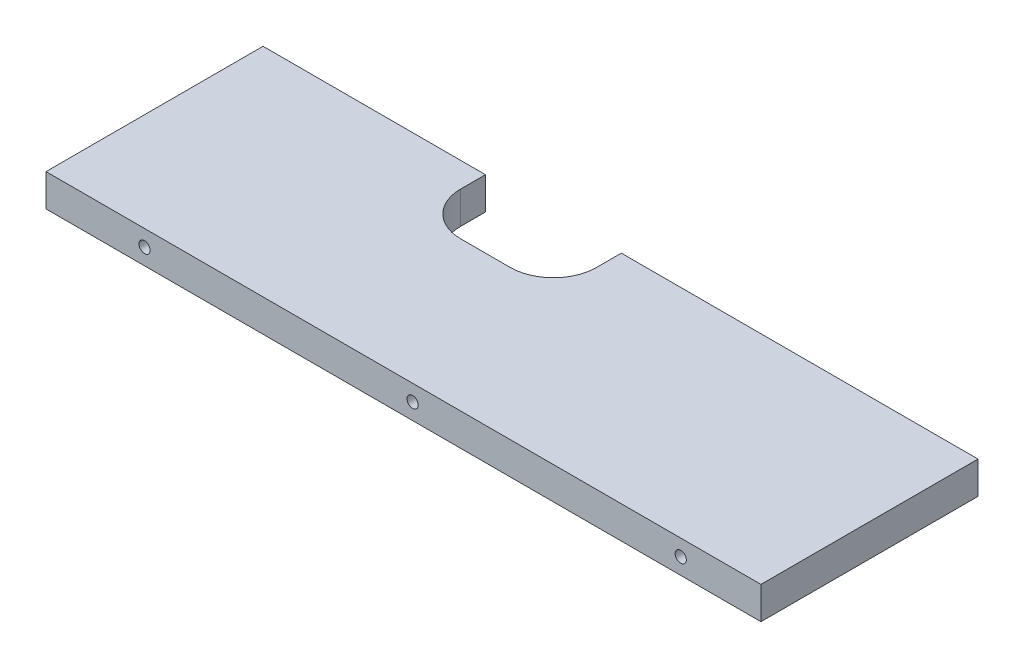
ISO-10303-21;
HEADER;
FILE_DESCRIPTION(('STEP AP214'),'2;1');
FILE_NAME('part.step','',(''),(''),'','','');
FILE_SCHEMA(('AUTOMOTIVE_DESIGN { 1 0 10303 214 1 1 1 1 }'));
ENDSEC;
DATA;
#1=APPLICATION_CONTEXT('core data for automotive mechanical design processes');
#2=APPLICATION_PROTOCOL_DEFINITION('international standard','automotive_design',2000,#1);
#3=PRODUCT_CONTEXT('',#1,'mechanical');
#4=PRODUCT('Part','Part','',(#3));
#5=PRODUCT_RELATED_PRODUCT_CATEGORY('part','',(#4));
#6=PRODUCT_DEFINITION_FORMATION('','',#4);
#7=PRODUCT_DEFINITION_CONTEXT('part definition',#1,'design');
#8=PRODUCT_DEFINITION('design','',#6,#7);
#9=PRODUCT_DEFINITION_SHAPE('','',#8);
#10=(LENGTH_UNIT() NAMED_UNIT(*) SI_UNIT(.MILLI.,.METRE.));
#11=(NAMED_UNIT(*) PLANE_ANGLE_UNIT() SI_UNIT($,.RADIAN.));
#12=(NAMED_UNIT(*) SI_UNIT($,.STERADIAN.) SOLID_ANGLE_UNIT());
#13=UNCERTAINTY_MEASURE_WITH_UNIT(LENGTH_MEASURE(1.E-05),#10,'distance_accuracy_value','');
#14=(GEOMETRIC_REPRESENTATION_CONTEXT(3) GLOBAL_UNCERTAINTY_ASSIGNED_CONTEXT((#13)) GLOBAL_UNIT_ASSIGNED_CONTEXT((#10,
#11,#12)) REPRESENTATION_CONTEXT('',''));
#15=CARTESIAN_POINT('',(0.,0.,0.));
#16=DIRECTION('',(0.,0.,1.));
#17=DIRECTION('',(1.,0.,0.));
#18=AXIS2_PLACEMENT_3D('',#15,#16,#17);
#19=CARTESIAN_POINT('',(0.,0.,0.));
#20=DIRECTION('',(0.,0.,1.));
#21=DIRECTION('',(1.,0.,0.));
#22=AXIS2_PLACEMENT_3D('',#19,#20,#21);
#23=PLANE('',#22);
#24=DIRECTION('',(-1.,0.,0.));
#25=VECTOR('',#24,1.);
#26=CARTESIAN_POINT('',(-105.2375,4.7625,0.));
#27=LINE('',#26,#25);
#28=CARTESIAN_POINT('',(-39.7625,4.7625,0.));
#29=VERTEX_POINT('',#28);
#30=CARTESIAN_POINT('',(-105.2375,4.7625,0.));
#31=VERTEX_POINT('',#30);
#32=EDGE_CURVE('E187',#29,#31,#27,.T.);
#33=ORIENTED_EDGE('',*,*,#32,.F.);
#34=DIRECTION('',(0.,1.,0.));
#35=VECTOR('',#34,1.);
#36=CARTESIAN_POINT('',(-39.7625,-4.7625,0.));
#37=LINE('',#36,#35);
#38=CARTESIAN_POINT('',(-39.7625,-4.7625,0.));
#39=VERTEX_POINT('',#38);
#40=EDGE_CURVE('E163',#39,#29,#37,.T.);
#41=ORIENTED_EDGE('',*,*,#40,.F.);
#42=DIRECTION('',(1.,0.,0.));
#43=VECTOR('',#42,1.);
#44=CARTESIAN_POINT('',(-105.2375,-4.7625,0.));
#45=LINE('',#44,#43);
#46=CARTESIAN_POINT('',(-105.2375,-4.7625,0.));
#47=VERTEX_POINT('',#46);
#48=EDGE_CURVE('E182',#47,#39,#45,.T.);
#49=ORIENTED_EDGE('',*,*,#48,.F.);
#50=DIRECTION('',(0.,-1.,0.));
#51=VECTOR('',#50,1.);
#52=CARTESIAN_POINT('',(-105.2375,4.7625,0.));
#53=LINE('',#52,#51);
#54=EDGE_CURVE('E165',#31,#47,#53,.T.);
#55=ORIENTED_EDGE('',*,*,#54,.F.);
#56=EDGE_LOOP('',(#33,#41,#49,#55));
#57=FACE_BOUND('',#56,.T.);
#58=ADVANCED_FACE('F38',(#57),#23,.F.);
#59=CARTESIAN_POINT('',(-105.2375,4.7625,63.9));
#60=DIRECTION('',(1.,0.,0.));
#61=DIRECTION('',(0.,0.,-1.));
#62=AXIS2_PLACEMENT_3D('',#59,#60,#61);
#63=PLANE('',#62);
#64=ORIENTED_EDGE('',*,*,#54,.T.);
#65=DIRECTION('',(0.,0.,-1.));
#66=VECTOR('',#65,1.);
#67=CARTESIAN_POINT('',(-105.2375,-4.7625,63.9));
#68=LINE('',#67,#66);
#69=CARTESIAN_POINT('',(-105.2375,-4.7625,63.9));
#70=VERTEX_POINT('',#69);
#71=EDGE_CURVE('E198',#70,#47,#68,.T.);
#72=ORIENTED_EDGE('',*,*,#71,.F.);
#73=DIRECTION('',(0.,-1.,0.));
#74=VECTOR('',#73,1.);
#75=CARTESIAN_POINT('',(-105.2375,4.7625,63.9));
#76=LINE('',#75,#74);
#77=CARTESIAN_POINT('',(-105.2375,4.7625,63.9));
#78=VERTEX_POINT('',#77);
#79=EDGE_CURVE('E168',#78,#70,#76,.T.);
#80=ORIENTED_EDGE('',*,*,#79,.F.);
#81=DIRECTION('',(0.,0.,-1.));
#82=VECTOR('',#81,1.);
#83=CARTESIAN_POINT('',(-105.2375,4.7625,63.9));
#84=LINE('',#83,#82);
#85=EDGE_CURVE('E178',#78,#31,#84,.T.);
#86=ORIENTED_EDGE('',*,*,#85,.T.);
#87=EDGE_LOOP('',(#64,#72,#80,#86));
#88=FACE_BOUND('',#87,.T.);
#89=ADVANCED_FACE('F242',(#88),#63,.F.);
#90=CARTESIAN_POINT('',(-105.2375,-4.7625,63.9));
#91=DIRECTION('',(0.,1.,0.));
#92=DIRECTION('',(0.,0.,1.));
#93=AXIS2_PLACEMENT_3D('',#90,#91,#92);
#94=PLANE('',#93);
#95=ORIENTED_EDGE('',*,*,#48,.T.);
#96=DIRECTION('',(0.,0.,1.));
#97=VECTOR('',#96,1.);
#98=CARTESIAN_POINT('',(-39.7625,-4.7625,0.));
#99=LINE('',#98,#97);
#100=CARTESIAN_POINT('',(-39.7625,-4.7625,7.3));
#101=VERTEX_POINT('',#100);
#102=EDGE_CURVE('E149',#39,#101,#99,.T.);
#103=ORIENTED_EDGE('',*,*,#102,.T.);
#104=CARTESIAN_POINT('',(-27.0625,-4.7625,7.3));
#105=DIRECTION('',(0.,1.,0.));
#106=DIRECTION('',(0.,0.,1.));
#107=AXIS2_PLACEMENT_3D('',#104,#105,#106);
#108=CIRCLE('',#107,12.7);
#109=CARTESIAN_POINT('',(-27.0625,-4.7625,20.));
#110=VERTEX_POINT('',#109);
#111=EDGE_CURVE('E11',#101,#110,#108,.T.);
#112=ORIENTED_EDGE('',*,*,#111,.T.);
#113=DIRECTION('',(1.,0.,0.));
#114=VECTOR('',#113,1.);
#115=CARTESIAN_POINT('',(-39.7625,-4.7625,20.));
#116=LINE('',#115,#114);
#117=CARTESIAN_POINT('',(-12.4625,-4.7625,20.));
#118=VERTEX_POINT('',#117);
#119=EDGE_CURVE('E151',#110,#118,#116,.T.);
#120=ORIENTED_EDGE('',*,*,#119,.T.);
#121=CARTESIAN_POINT('',(-12.4625,-4.7625,7.3));
#122=DIRECTION('',(0.,1.,0.));
#123=DIRECTION('',(0.,0.,1.));
#124=AXIS2_PLACEMENT_3D('',#121,#122,#123);
#125=CIRCLE('',#124,12.7);
#126=CARTESIAN_POINT('',(0.237500000000003,-4.7625,7.3));
#127=VERTEX_POINT('',#126);
#128=EDGE_CURVE('E212',#118,#127,#125,.T.);
#129=ORIENTED_EDGE('',*,*,#128,.T.);
#130=DIRECTION('',(0.,0.,-1.));
#131=VECTOR('',#130,1.);
#132=CARTESIAN_POINT('',(0.237500000000002,-4.7625,0.));
#133=LINE('',#132,#131);
#134=CARTESIAN_POINT('',(0.237500000000002,-4.7625,0.));
#135=VERTEX_POINT('',#134);
#136=EDGE_CURVE('E155',#127,#135,#133,.T.);
#137=ORIENTED_EDGE('',*,*,#136,.T.);
#138=CARTESIAN_POINT('',(105.2375,-4.7625,0.));
#139=VERTEX_POINT('',#138);
#140=EDGE_CURVE('E181',#135,#139,#45,.T.);
#141=ORIENTED_EDGE('',*,*,#140,.T.);
#142=DIRECTION('',(0.,0.,-1.));
#143=VECTOR('',#142,1.);
#144=CARTESIAN_POINT('',(105.2375,-4.7625,63.9));
#145=LINE('',#144,#143);
#146=CARTESIAN_POINT('',(105.2375,-4.7625,63.9));
#147=VERTEX_POINT('',#146);
#148=EDGE_CURVE('E195',#147,#139,#145,.T.);
#149=ORIENTED_EDGE('',*,*,#148,.F.);
#150=DIRECTION('',(1.,0.,0.));
#151=VECTOR('',#150,1.);
#152=CARTESIAN_POINT('',(-105.2375,-4.7625,63.9));
#153=LINE('',#152,#151);
#154=EDGE_CURVE('E171',#70,#147,#153,.T.);
#155=ORIENTED_EDGE('',*,*,#154,.F.);
#156=ORIENTED_EDGE('',*,*,#71,.T.);
#157=EDGE_LOOP('',(#95,#103,#112,#120,#129,#137,#141,#149,#155,#156));
#158=FACE_BOUND('',#157,.T.);
#159=ADVANCED_FACE('F216',(#158),#94,.F.);
#160=CARTESIAN_POINT('',(105.2375,4.7625,63.9));
#161=DIRECTION('',(-1.,0.,0.));
#162=DIRECTION('',(0.,0.,1.));
#163=AXIS2_PLACEMENT_3D('',#160,#161,#162);
#164=PLANE('',#163);
#165=DIRECTION('',(0.,1.,0.));
#166=VECTOR('',#165,1.);
#167=CARTESIAN_POINT('',(105.2375,4.7625,0.));
#168=LINE('',#167,#166);
#169=CARTESIAN_POINT('',(105.2375,4.7625,0.));
#170=VERTEX_POINT('',#169);
#171=EDGE_CURVE('E185',#139,#170,#168,.T.);
#172=ORIENTED_EDGE('',*,*,#171,.T.);
#173=DIRECTION('',(0.,0.,-1.));
#174=VECTOR('',#173,1.);
#175=CARTESIAN_POINT('',(105.2375,4.7625,63.9));
#176=LINE('',#175,#174);
#177=CARTESIAN_POINT('',(105.2375,4.7625,63.9));
#178=VERTEX_POINT('',#177);
#179=EDGE_CURVE('E192',#178,#170,#176,.T.);
#180=ORIENTED_EDGE('',*,*,#179,.F.);
#181=DIRECTION('',(0.,1.,0.));
#182=VECTOR('',#181,1.);
#183=CARTESIAN_POINT('',(105.2375,4.7625,63.9));
#184=LINE('',#183,#182);
#185=EDGE_CURVE('E174',#147,#178,#184,.T.);
#186=ORIENTED_EDGE('',*,*,#185,.F.);
#187=ORIENTED_EDGE('',*,*,#148,.T.);
#188=EDGE_LOOP('',(#172,#180,#186,#187));
#189=FACE_BOUND('',#188,.T.);
#190=ADVANCED_FACE('F254',(#189),#164,.F.);
#191=CARTESIAN_POINT('',(-105.2375,4.7625,63.9));
#192=DIRECTION('',(0.,-1.,0.));
#193=DIRECTION('',(0.,0.,-1.));
#194=AXIS2_PLACEMENT_3D('',#191,#192,#193);
#195=PLANE('',#194);
#196=DIRECTION('',(1.,0.,0.));
#197=VECTOR('',#196,1.);
#198=CARTESIAN_POINT('',(-39.7625,4.7625,20.));
#199=LINE('',#198,#197);
#200=CARTESIAN_POINT('',(-27.0625,4.7625,20.));
#201=VERTEX_POINT('',#200);
#202=CARTESIAN_POINT('',(-12.4625,4.7625,20.));
#203=VERTEX_POINT('',#202);
#204=EDGE_CURVE('E159',#201,#203,#199,.T.);
#205=ORIENTED_EDGE('',*,*,#204,.F.);
#206=CARTESIAN_POINT('',(-27.0625,4.7625,7.3));
#207=DIRECTION('',(0.,-1.,0.));
#208=DIRECTION('',(0.,0.,-1.));
#209=AXIS2_PLACEMENT_3D('',#206,#207,#208);
#210=CIRCLE('',#209,12.7);
#211=CARTESIAN_POINT('',(-39.7625,4.7625,7.3));
#212=VERTEX_POINT('',#211);
#213=EDGE_CURVE('E46',#201,#212,#210,.T.);
#214=ORIENTED_EDGE('',*,*,#213,.T.);
#215=DIRECTION('',(0.,0.,1.));
#216=VECTOR('',#215,1.);
#217=CARTESIAN_POINT('',(-39.7625,4.7625,0.));
#218=LINE('',#217,#216);
#219=EDGE_CURVE('E148',#29,#212,#218,.T.);
#220=ORIENTED_EDGE('',*,*,#219,.F.);
#221=ORIENTED_EDGE('',*,*,#32,.T.);
#222=ORIENTED_EDGE('',*,*,#85,.F.);
#223=DIRECTION('',(-1.,0.,0.));
#224=VECTOR('',#223,1.);
#225=CARTESIAN_POINT('',(-105.2375,4.7625,63.9));
#226=LINE('',#225,#224);
#227=EDGE_CURVE('E176',#178,#78,#226,.T.);
#228=ORIENTED_EDGE('',*,*,#227,.F.);
#229=ORIENTED_EDGE('',*,*,#179,.T.);
#230=CARTESIAN_POINT('',(0.237500000000002,4.7625,0.));
#231=VERTEX_POINT('',#230);
#232=EDGE_CURVE('E172',#170,#231,#27,.T.);
#233=ORIENTED_EDGE('',*,*,#232,.T.);
#234=DIRECTION('',(0.,0.,-1.));
#235=VECTOR('',#234,1.);
#236=CARTESIAN_POINT('',(0.237500000000002,4.7625,0.));
#237=LINE('',#236,#235);
#238=CARTESIAN_POINT('',(0.237500000000003,4.7625,7.3));
#239=VERTEX_POINT('',#238);
#240=EDGE_CURVE('E152',#239,#231,#237,.T.);
#241=ORIENTED_EDGE('',*,*,#240,.F.);
#242=CARTESIAN_POINT('',(-12.4625,4.7625,7.3));
#243=DIRECTION('',(0.,-1.,0.));
#244=DIRECTION('',(0.,0.,-1.));
#245=AXIS2_PLACEMENT_3D('',#242,#243,#244);
#246=CIRCLE('',#245,12.7);
#247=EDGE_CURVE('E210',#239,#203,#246,.T.);
#248=ORIENTED_EDGE('',*,*,#247,.T.);
#249=EDGE_LOOP('',(#205,#214,#220,#221,#222,#228,#229,#233,#241,#248));
#250=FACE_BOUND('',#249,.T.);
#251=ADVANCED_FACE('F227',(#250),#195,.F.);
#252=CARTESIAN_POINT('',(0.,0.,63.9));
#253=DIRECTION('',(0.,0.,1.));
#254=DIRECTION('',(1.,0.,0.));
#255=AXIS2_PLACEMENT_3D('',#252,#253,#254);
#256=PLANE('',#255);
#257=CARTESIAN_POINT('',(-76.2285,0.,63.9));
#258=DIRECTION('',(0.,0.,1.));
#259=DIRECTION('',(1.,0.,0.));
#260=AXIS2_PLACEMENT_3D('',#257,#258,#259);
#261=CIRCLE('',#260,1.65);
#262=CARTESIAN_POINT('',(-74.5785,0.,63.9));
#263=VERTEX_POINT('',#262);
#264=EDGE_CURVE('E132',#263,#263,#261,.T.);
#265=ORIENTED_EDGE('',*,*,#264,.F.);
#266=EDGE_LOOP('',(#265));
#267=FACE_BOUND('',#266,.T.);
#268=CARTESIAN_POINT('',(2.69949999999999,0.,63.9));
#269=DIRECTION('',(0.,0.,1.));
#270=DIRECTION('',(1.,0.,0.));
#271=AXIS2_PLACEMENT_3D('',#268,#269,#270);
#272=CIRCLE('',#271,1.64999999999999);
#273=CARTESIAN_POINT('',(4.34949999999999,0.,63.9));
#274=VERTEX_POINT('',#273);
#275=EDGE_CURVE('E131',#274,#274,#272,.T.);
#276=ORIENTED_EDGE('',*,*,#275,.F.);
#277=EDGE_LOOP('',(#276));
#278=FACE_BOUND('',#277,.T.);
#279=CARTESIAN_POINT('',(81.6285,0.,63.9));
#280=DIRECTION('',(0.,0.,1.));
#281=DIRECTION('',(1.,0.,0.));
#282=AXIS2_PLACEMENT_3D('',#279,#280,#281);
#283=CIRCLE('',#282,1.65);
#284=CARTESIAN_POINT('',(83.2785,0.,63.9));
#285=VERTEX_POINT('',#284);
#286=EDGE_CURVE('E142',#285,#285,#283,.T.);
#287=ORIENTED_EDGE('',*,*,#286,.F.);
#288=EDGE_LOOP('',(#287));
#289=FACE_BOUND('',#288,.T.);
#290=ORIENTED_EDGE('',*,*,#79,.T.);
#291=ORIENTED_EDGE('',*,*,#154,.T.);
#292=ORIENTED_EDGE('',*,*,#185,.T.);
#293=ORIENTED_EDGE('',*,*,#227,.T.);
#294=EDGE_LOOP('',(#290,#291,#292,#293));
#295=FACE_BOUND('',#294,.T.);
#296=ADVANCED_FACE('F245',(#267,#278,#289,#295),#256,.T.);
#297=ORIENTED_EDGE('',*,*,#140,.F.);
#298=DIRECTION('',(0.,1.,0.));
#299=VECTOR('',#298,1.);
#300=CARTESIAN_POINT('',(0.237500000000002,-4.7625,0.));
#301=LINE('',#300,#299);
#302=EDGE_CURVE('E157',#135,#231,#301,.T.);
#303=ORIENTED_EDGE('',*,*,#302,.T.);
#304=ORIENTED_EDGE('',*,*,#232,.F.);
#305=ORIENTED_EDGE('',*,*,#171,.F.);
#306=EDGE_LOOP('',(#297,#303,#304,#305));
#307=FACE_BOUND('',#306,.T.);
#308=ADVANCED_FACE('F253',(#307),#23,.F.);
#309=CARTESIAN_POINT('',(-39.7625,-4.7625,0.));
#310=DIRECTION('',(-1.,0.,0.));
#311=DIRECTION('',(0.,0.,1.));
#312=AXIS2_PLACEMENT_3D('',#309,#310,#311);
#313=PLANE('',#312);
#314=ORIENTED_EDGE('',*,*,#219,.T.);
#315=DIRECTION('',(0.,1.,0.));
#316=VECTOR('',#315,1.);
#317=CARTESIAN_POINT('',(-39.7625,-4.7625,7.3));
#318=LINE('',#317,#316);
#319=EDGE_CURVE('E53',#212,#101,#318,.F.);
#320=ORIENTED_EDGE('',*,*,#319,.T.);
#321=ORIENTED_EDGE('',*,*,#102,.F.);
#322=ORIENTED_EDGE('',*,*,#40,.T.);
#323=EDGE_LOOP('',(#314,#320,#321,#322));
#324=FACE_BOUND('',#323,.T.);
#325=ADVANCED_FACE('F234',(#324),#313,.F.);
#326=CARTESIAN_POINT('',(0.237500000000002,-4.7625,0.));
#327=DIRECTION('',(1.,0.,0.));
#328=DIRECTION('',(0.,0.,-1.));
#329=AXIS2_PLACEMENT_3D('',#326,#327,#328);
#330=PLANE('',#329);
#331=ORIENTED_EDGE('',*,*,#136,.F.);
#332=DIRECTION('',(0.,1.,0.));
#333=VECTOR('',#332,1.);
#334=CARTESIAN_POINT('',(0.237500000000003,4.7625,7.3));
#335=LINE('',#334,#333);
#336=EDGE_CURVE('E201',#127,#239,#335,.T.);
#337=ORIENTED_EDGE('',*,*,#336,.T.);
#338=ORIENTED_EDGE('',*,*,#240,.T.);
#339=ORIENTED_EDGE('',*,*,#302,.F.);
#340=EDGE_LOOP('',(#331,#337,#338,#339));
#341=FACE_BOUND('',#340,.T.);
#342=ADVANCED_FACE('F223',(#341),#330,.F.);
#343=CARTESIAN_POINT('',(-39.7625,-4.7625,20.));
#344=DIRECTION('',(0.,0.,1.));
#345=DIRECTION('',(1.,0.,0.));
#346=AXIS2_PLACEMENT_3D('',#343,#344,#345);
#347=PLANE('',#346);
#348=ORIENTED_EDGE('',*,*,#204,.T.);
#349=DIRECTION('',(0.,1.,0.));
#350=VECTOR('',#349,1.);
#351=CARTESIAN_POINT('',(-12.4625,-4.7625,20.));
#352=LINE('',#351,#350);
#353=EDGE_CURVE('E207',#203,#118,#352,.F.);
#354=ORIENTED_EDGE('',*,*,#353,.T.);
#355=ORIENTED_EDGE('',*,*,#119,.F.);
#356=DIRECTION('',(0.,1.,0.));
#357=VECTOR('',#356,1.);
#358=CARTESIAN_POINT('',(-27.0625,4.7625,20.));
#359=LINE('',#358,#357);
#360=EDGE_CURVE('E204',#110,#201,#359,.T.);
#361=ORIENTED_EDGE('',*,*,#360,.T.);
#362=EDGE_LOOP('',(#348,#354,#355,#361));
#363=FACE_BOUND('',#362,.T.);
#364=ADVANCED_FACE('F229',(#363),#347,.F.);
#365=CARTESIAN_POINT('',(-12.4625,-4.7625,7.3));
#366=DIRECTION('',(0.,-1.,0.));
#367=DIRECTION('',(0.,0.,-1.));
#368=AXIS2_PLACEMENT_3D('',#365,#366,#367);
#369=CYLINDRICAL_SURFACE('',#368,12.7);
#370=ORIENTED_EDGE('',*,*,#128,.F.);
#371=ORIENTED_EDGE('',*,*,#353,.F.);
#372=ORIENTED_EDGE('',*,*,#247,.F.);
#373=ORIENTED_EDGE('',*,*,#336,.F.);
#374=EDGE_LOOP('',(#370,#371,#372,#373));
#375=FACE_BOUND('',#374,.T.);
#376=ADVANCED_FACE('F226',(#375),#369,.F.);
#377=CARTESIAN_POINT('',(-27.0625,-4.7625,7.3));
#378=DIRECTION('',(0.,-1.,0.));
#379=DIRECTION('',(0.,0.,-1.));
#380=AXIS2_PLACEMENT_3D('',#377,#378,#379);
#381=CYLINDRICAL_SURFACE('',#380,12.7);
#382=ORIENTED_EDGE('',*,*,#111,.F.);
#383=ORIENTED_EDGE('',*,*,#319,.F.);
#384=ORIENTED_EDGE('',*,*,#213,.F.);
#385=ORIENTED_EDGE('',*,*,#360,.F.);
#386=EDGE_LOOP('',(#382,#383,#384,#385));
#387=FACE_BOUND('',#386,.T.);
#388=ADVANCED_FACE('F40',(#387),#381,.F.);
#389=CARTESIAN_POINT('',(81.6285,0.,51.2));
#390=DIRECTION('',(0.,0.,1.));
#391=DIRECTION('',(1.,0.,0.));
#392=AXIS2_PLACEMENT_3D('',#389,#390,#391);
#393=CONICAL_SURFACE('',#392,1.65,1.02974425867665);
#394=CARTESIAN_POINT('',(81.6285,0.,50.2085799786045));
#395=VERTEX_POINT('',#394);
#396=VERTEX_LOOP('',#395);
#397=FACE_BOUND('',#396,.T.);
#398=CARTESIAN_POINT('',(81.6285,0.,51.2));
#399=DIRECTION('',(0.,0.,1.));
#400=DIRECTION('',(1.,0.,0.));
#401=AXIS2_PLACEMENT_3D('',#398,#399,#400);
#402=CIRCLE('',#401,1.65);
#403=CARTESIAN_POINT('',(83.2785,0.,51.2));
#404=VERTEX_POINT('',#403);
#405=EDGE_CURVE('E145',#404,#404,#402,.T.);
#406=ORIENTED_EDGE('',*,*,#405,.T.);
#407=EDGE_LOOP('',(#406));
#408=FACE_BOUND('',#407,.T.);
#409=ADVANCED_FACE('F286',(#397,#408),#393,.F.);
#410=CARTESIAN_POINT('',(81.6285,0.,63.9));
#411=DIRECTION('',(0.,0.,1.));
#412=DIRECTION('',(1.,0.,0.));
#413=AXIS2_PLACEMENT_3D('',#410,#411,#412);
#414=CYLINDRICAL_SURFACE('',#413,1.65);
#415=ORIENTED_EDGE('',*,*,#405,.F.);
#416=EDGE_LOOP('',(#415));
#417=FACE_BOUND('',#416,.T.);
#418=ORIENTED_EDGE('',*,*,#286,.T.);
#419=EDGE_LOOP('',(#418));
#420=FACE_BOUND('',#419,.T.);
#421=ADVANCED_FACE('F289',(#417,#420),#414,.F.);
#422=CARTESIAN_POINT('',(2.69949999999999,0.,51.2));
#423=DIRECTION('',(0.,0.,1.));
#424=DIRECTION('',(1.,0.,0.));
#425=AXIS2_PLACEMENT_3D('',#422,#423,#424);
#426=CONICAL_SURFACE('',#425,1.64999999999999,1.02974425867665);
#427=CARTESIAN_POINT('',(2.69949999999999,0.,50.2085799786045));
#428=VERTEX_POINT('',#427);
#429=VERTEX_LOOP('',#428);
#430=FACE_BOUND('',#429,.T.);
#431=CARTESIAN_POINT('',(2.69949999999999,0.,51.2));
#432=DIRECTION('',(0.,0.,1.));
#433=DIRECTION('',(1.,0.,0.));
#434=AXIS2_PLACEMENT_3D('',#431,#432,#433);
#435=CIRCLE('',#434,1.64999999999999);
#436=CARTESIAN_POINT('',(4.34949999999999,0.,51.2));
#437=VERTEX_POINT('',#436);
#438=EDGE_CURVE('E135',#437,#437,#435,.T.);
#439=ORIENTED_EDGE('',*,*,#438,.T.);
#440=EDGE_LOOP('',(#439));
#441=FACE_BOUND('',#440,.T.);
#442=ADVANCED_FACE('F293',(#430,#441),#426,.F.);
#443=CARTESIAN_POINT('',(2.69949999999999,0.,63.9));
#444=DIRECTION('',(0.,0.,1.));
#445=DIRECTION('',(1.,0.,0.));
#446=AXIS2_PLACEMENT_3D('',#443,#444,#445);
#447=CYLINDRICAL_SURFACE('',#446,1.64999999999999);
#448=ORIENTED_EDGE('',*,*,#438,.F.);
#449=EDGE_LOOP('',(#448));
#450=FACE_BOUND('',#449,.T.);
#451=ORIENTED_EDGE('',*,*,#275,.T.);
#452=EDGE_LOOP('',(#451));
#453=FACE_BOUND('',#452,.T.);
#454=ADVANCED_FACE('F125',(#450,#453),#447,.F.);
#455=CARTESIAN_POINT('',(-76.2285,0.,51.2));
#456=DIRECTION('',(0.,0.,1.));
#457=DIRECTION('',(1.,0.,0.));
#458=AXIS2_PLACEMENT_3D('',#455,#456,#457);
#459=CONICAL_SURFACE('',#458,1.65,1.02974425867665);
#460=CARTESIAN_POINT('',(-76.2285,0.,50.2085799786045));
#461=VERTEX_POINT('',#460);
#462=VERTEX_LOOP('',#461);
#463=FACE_BOUND('',#462,.T.);
#464=CARTESIAN_POINT('',(-76.2285,0.,51.2));
#465=DIRECTION('',(0.,0.,1.));
#466=DIRECTION('',(1.,0.,0.));
#467=AXIS2_PLACEMENT_3D('',#464,#465,#466);
#468=CIRCLE('',#467,1.65);
#469=CARTESIAN_POINT('',(-74.5785,0.,51.2));
#470=VERTEX_POINT('',#469);
#471=EDGE_CURVE('E129',#470,#470,#468,.T.);
#472=ORIENTED_EDGE('',*,*,#471,.T.);
#473=EDGE_LOOP('',(#472));
#474=FACE_BOUND('',#473,.T.);
#475=ADVANCED_FACE('F121',(#463,#474),#459,.F.);
#476=CARTESIAN_POINT('',(-76.2285,0.,63.9));
#477=DIRECTION('',(0.,0.,1.));
#478=DIRECTION('',(1.,0.,0.));
#479=AXIS2_PLACEMENT_3D('',#476,#477,#478);
#480=CYLINDRICAL_SURFACE('',#479,1.65);
#481=ORIENTED_EDGE('',*,*,#471,.F.);
#482=EDGE_LOOP('',(#481));
#483=FACE_BOUND('',#482,.T.);
#484=ORIENTED_EDGE('',*,*,#264,.T.);
#485=EDGE_LOOP('',(#484));
#486=FACE_BOUND('',#485,.T.);
#487=ADVANCED_FACE('F124',(#483,#486),#480,.F.);
#488=CLOSED_SHELL('',(#58,#89,#159,#190,#251,#296,#308,#325,#342,#364,#376,#388,#409,#421,#442,
#454,#475,#487));
#489=MANIFOLD_SOLID_BREP('B2',#488);
#490=ADVANCED_BREP_SHAPE_REPRESENTATION('',(#18,#489),#14);
#491=SHAPE_DEFINITION_REPRESENTATION(#9,#490);
ENDSEC;
END-ISO-10303-21;
